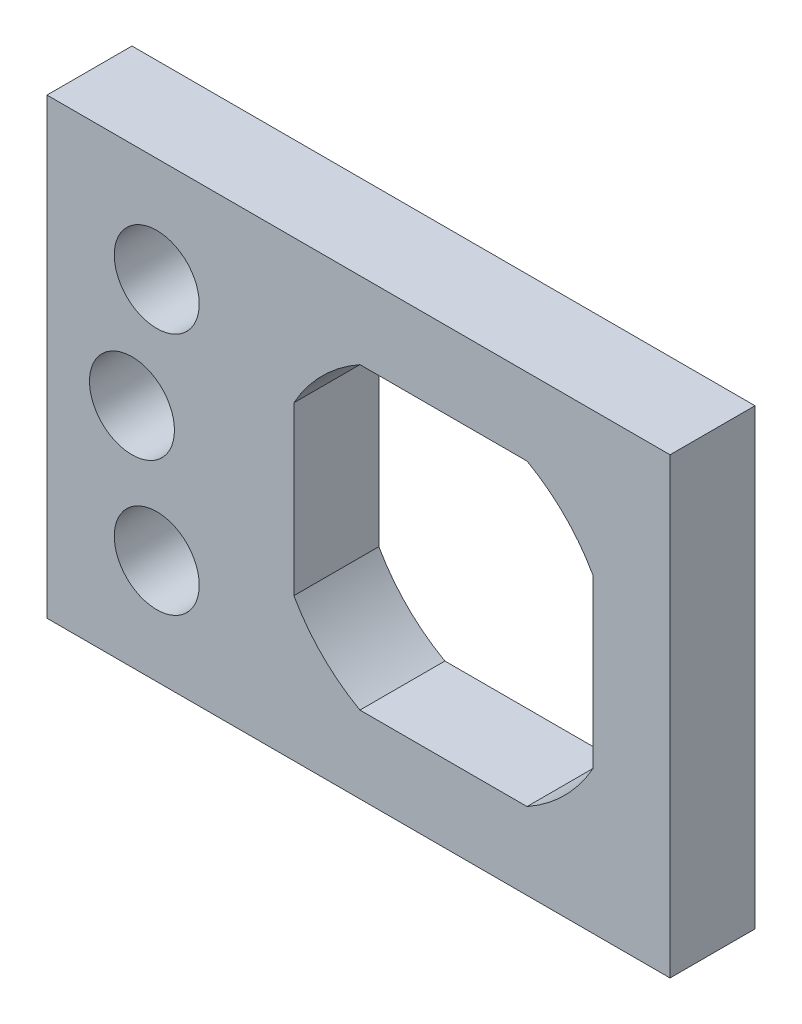
ISO-10303-21;
HEADER;
FILE_DESCRIPTION(('STEP AP214'),'2;1');
FILE_NAME('part.step','',(''),(''),'','','');
FILE_SCHEMA(('AUTOMOTIVE_DESIGN { 1 0 10303 214 1 1 1 1 }'));
ENDSEC;
DATA;
#1=APPLICATION_CONTEXT('core data for automotive mechanical design processes');
#2=APPLICATION_PROTOCOL_DEFINITION('international standard','automotive_design',2000,#1);
#3=PRODUCT_CONTEXT('',#1,'mechanical');
#4=PRODUCT('Part','Part','',(#3));
#5=PRODUCT_RELATED_PRODUCT_CATEGORY('part','',(#4));
#6=PRODUCT_DEFINITION_FORMATION('','',#4);
#7=PRODUCT_DEFINITION_CONTEXT('part definition',#1,'design');
#8=PRODUCT_DEFINITION('design','',#6,#7);
#9=PRODUCT_DEFINITION_SHAPE('','',#8);
#10=(LENGTH_UNIT() NAMED_UNIT(*) SI_UNIT(.MILLI.,.METRE.));
#11=(NAMED_UNIT(*) PLANE_ANGLE_UNIT() SI_UNIT($,.RADIAN.));
#12=(NAMED_UNIT(*) SI_UNIT($,.STERADIAN.) SOLID_ANGLE_UNIT());
#13=UNCERTAINTY_MEASURE_WITH_UNIT(LENGTH_MEASURE(1.E-05),#10,'distance_accuracy_value','');
#14=(GEOMETRIC_REPRESENTATION_CONTEXT(3) GLOBAL_UNCERTAINTY_ASSIGNED_CONTEXT((#13)) GLOBAL_UNIT_ASSIGNED_CONTEXT((#10,
#11,#12)) REPRESENTATION_CONTEXT('',''));
#15=CARTESIAN_POINT('',(0.,0.,0.));
#16=DIRECTION('',(0.,0.,1.));
#17=DIRECTION('',(1.,0.,0.));
#18=AXIS2_PLACEMENT_3D('',#15,#16,#17);
#19=CARTESIAN_POINT('',(0.,0.,0.));
#20=DIRECTION('',(0.,-1.,0.));
#21=DIRECTION('',(0.,0.,-1.));
#22=AXIS2_PLACEMENT_3D('',#19,#20,#21);
#23=PLANE('',#22);
#24=DIRECTION('',(-1.,0.,0.));
#25=VECTOR('',#24,1.);
#26=CARTESIAN_POINT('',(0.,0.,-15.));
#27=LINE('',#26,#25);
#28=CARTESIAN_POINT('',(0.,0.,-15.));
#29=VERTEX_POINT('',#28);
#30=CARTESIAN_POINT('',(-110.,0.,-15.));
#31=VERTEX_POINT('',#30);
#32=EDGE_CURVE('E173',#29,#31,#27,.T.);
#33=ORIENTED_EDGE('',*,*,#32,.T.);
#34=DIRECTION('',(0.,0.,-1.));
#35=VECTOR('',#34,1.);
#36=CARTESIAN_POINT('',(-110.,0.,0.));
#37=LINE('',#36,#35);
#38=CARTESIAN_POINT('',(-110.,0.,0.));
#39=VERTEX_POINT('',#38);
#40=EDGE_CURVE('E11',#39,#31,#37,.T.);
#41=ORIENTED_EDGE('',*,*,#40,.F.);
#42=DIRECTION('',(-1.,0.,0.));
#43=VECTOR('',#42,1.);
#44=CARTESIAN_POINT('',(0.,0.,0.));
#45=LINE('',#44,#43);
#46=CARTESIAN_POINT('',(0.,0.,0.));
#47=VERTEX_POINT('',#46);
#48=EDGE_CURVE('E137',#47,#39,#45,.T.);
#49=ORIENTED_EDGE('',*,*,#48,.F.);
#50=DIRECTION('',(0.,0.,-1.));
#51=VECTOR('',#50,1.);
#52=CARTESIAN_POINT('',(0.,0.,0.));
#53=LINE('',#52,#51);
#54=EDGE_CURVE('E53',#47,#29,#53,.T.);
#55=ORIENTED_EDGE('',*,*,#54,.T.);
#56=EDGE_LOOP('',(#33,#41,#49,#55));
#57=FACE_BOUND('',#56,.T.);
#58=ADVANCED_FACE('F34',(#57),#23,.F.);
#59=CARTESIAN_POINT('',(-110.,0.,0.));
#60=DIRECTION('',(1.,0.,0.));
#61=DIRECTION('',(0.,0.,-1.));
#62=AXIS2_PLACEMENT_3D('',#59,#60,#61);
#63=PLANE('',#62);
#64=DIRECTION('',(0.,-1.,0.));
#65=VECTOR('',#64,1.);
#66=CARTESIAN_POINT('',(-110.,0.,-15.));
#67=LINE('',#66,#65);
#68=CARTESIAN_POINT('',(-110.,-80.,-15.));
#69=VERTEX_POINT('',#68);
#70=EDGE_CURVE('E143',#31,#69,#67,.T.);
#71=ORIENTED_EDGE('',*,*,#70,.T.);
#72=DIRECTION('',(0.,0.,-1.));
#73=VECTOR('',#72,1.);
#74=CARTESIAN_POINT('',(-110.,-80.,0.));
#75=LINE('',#74,#73);
#76=CARTESIAN_POINT('',(-110.,-80.,0.));
#77=VERTEX_POINT('',#76);
#78=EDGE_CURVE('E44',#77,#69,#75,.T.);
#79=ORIENTED_EDGE('',*,*,#78,.F.);
#80=DIRECTION('',(0.,-1.,0.));
#81=VECTOR('',#80,1.);
#82=CARTESIAN_POINT('',(-110.,0.,0.));
#83=LINE('',#82,#81);
#84=EDGE_CURVE('E131',#39,#77,#83,.T.);
#85=ORIENTED_EDGE('',*,*,#84,.F.);
#86=ORIENTED_EDGE('',*,*,#40,.T.);
#87=EDGE_LOOP('',(#71,#79,#85,#86));
#88=FACE_BOUND('',#87,.T.);
#89=ADVANCED_FACE('F142',(#88),#63,.F.);
#90=CARTESIAN_POINT('',(0.,-80.,0.));
#91=DIRECTION('',(0.,-1.,0.));
#92=DIRECTION('',(1.,0.,0.));
#93=AXIS2_PLACEMENT_3D('',#90,#91,#92);
#94=PLANE('',#93);
#95=DIRECTION('',(-1.,0.,0.));
#96=VECTOR('',#95,1.);
#97=CARTESIAN_POINT('',(0.,-80.,-15.));
#98=LINE('',#97,#96);
#99=CARTESIAN_POINT('',(0.,-80.,-15.));
#100=VERTEX_POINT('',#99);
#101=EDGE_CURVE('E176',#100,#69,#98,.T.);
#102=ORIENTED_EDGE('',*,*,#101,.F.);
#103=DIRECTION('',(0.,0.,-1.));
#104=VECTOR('',#103,1.);
#105=CARTESIAN_POINT('',(0.,-80.,0.));
#106=LINE('',#105,#104);
#107=CARTESIAN_POINT('',(0.,-80.,0.));
#108=VERTEX_POINT('',#107);
#109=EDGE_CURVE('E91',#108,#100,#106,.T.);
#110=ORIENTED_EDGE('',*,*,#109,.F.);
#111=DIRECTION('',(-1.,0.,0.));
#112=VECTOR('',#111,1.);
#113=CARTESIAN_POINT('',(0.,-80.,0.));
#114=LINE('',#113,#112);
#115=EDGE_CURVE('E136',#108,#77,#114,.T.);
#116=ORIENTED_EDGE('',*,*,#115,.T.);
#117=ORIENTED_EDGE('',*,*,#78,.T.);
#118=EDGE_LOOP('',(#102,#110,#116,#117));
#119=FACE_BOUND('',#118,.T.);
#120=ADVANCED_FACE('F147',(#119),#94,.T.);
#121=CARTESIAN_POINT('',(-40.,-40.,0.));
#122=DIRECTION('',(0.,0.,-1.));
#123=DIRECTION('',(-1.,0.,0.));
#124=AXIS2_PLACEMENT_3D('',#121,#122,#123);
#125=CYLINDRICAL_SURFACE('',#124,30.25);
#126=CARTESIAN_POINT('',(-40.,-40.,-15.));
#127=DIRECTION('',(0.,0.,1.));
#128=DIRECTION('',(1.,0.,0.));
#129=AXIS2_PLACEMENT_3D('',#126,#127,#128);
#130=CIRCLE('',#129,30.25);
#131=CARTESIAN_POINT('',(-13.5897747075115,-25.25,-15.));
#132=VERTEX_POINT('',#131);
#133=CARTESIAN_POINT('',(-25.25,-13.5897747075115,-15.));
#134=VERTEX_POINT('',#133);
#135=EDGE_CURVE('E154',#132,#134,#130,.T.);
#136=ORIENTED_EDGE('',*,*,#135,.F.);
#137=DIRECTION('',(0.,0.,-1.));
#138=VECTOR('',#137,1.);
#139=CARTESIAN_POINT('',(-13.5897747075115,-25.25,0.));
#140=LINE('',#139,#138);
#141=CARTESIAN_POINT('',(-13.5897747075115,-25.25,0.));
#142=VERTEX_POINT('',#141);
#143=EDGE_CURVE('E38',#142,#132,#140,.T.);
#144=ORIENTED_EDGE('',*,*,#143,.F.);
#145=CARTESIAN_POINT('',(-40.,-40.,0.));
#146=DIRECTION('',(0.,0.,1.));
#147=DIRECTION('',(1.,0.,0.));
#148=AXIS2_PLACEMENT_3D('',#145,#146,#147);
#149=CIRCLE('',#148,30.25);
#150=CARTESIAN_POINT('',(-25.25,-13.5897747075115,0.));
#151=VERTEX_POINT('',#150);
#152=EDGE_CURVE('E181',#142,#151,#149,.T.);
#153=ORIENTED_EDGE('',*,*,#152,.T.);
#154=DIRECTION('',(0.,0.,-1.));
#155=VECTOR('',#154,1.);
#156=CARTESIAN_POINT('',(-25.25,-13.5897747075115,0.));
#157=LINE('',#156,#155);
#158=EDGE_CURVE('E150',#151,#134,#157,.T.);
#159=ORIENTED_EDGE('',*,*,#158,.T.);
#160=EDGE_LOOP('',(#136,#144,#153,#159));
#161=FACE_BOUND('',#160,.T.);
#162=ADVANCED_FACE('F204',(#161),#125,.F.);
#163=CARTESIAN_POINT('',(-13.5897747075115,0.,0.));
#164=DIRECTION('',(-1.,0.,0.));
#165=DIRECTION('',(0.,-1.,0.));
#166=AXIS2_PLACEMENT_3D('',#163,#164,#165);
#167=PLANE('',#166);
#168=DIRECTION('',(0.,1.,0.));
#169=VECTOR('',#168,1.);
#170=CARTESIAN_POINT('',(-13.5897747075115,0.,-15.));
#171=LINE('',#170,#169);
#172=CARTESIAN_POINT('',(-13.5897747075115,-54.75,-15.));
#173=VERTEX_POINT('',#172);
#174=EDGE_CURVE('E157',#173,#132,#171,.T.);
#175=ORIENTED_EDGE('',*,*,#174,.F.);
#176=DIRECTION('',(0.,0.,-1.));
#177=VECTOR('',#176,1.);
#178=CARTESIAN_POINT('',(-13.5897747075115,-54.75,0.));
#179=LINE('',#178,#177);
#180=CARTESIAN_POINT('',(-13.5897747075115,-54.75,0.));
#181=VERTEX_POINT('',#180);
#182=EDGE_CURVE('E194',#181,#173,#179,.T.);
#183=ORIENTED_EDGE('',*,*,#182,.F.);
#184=DIRECTION('',(0.,1.,0.));
#185=VECTOR('',#184,1.);
#186=CARTESIAN_POINT('',(-13.5897747075115,0.,0.));
#187=LINE('',#186,#185);
#188=EDGE_CURVE('E203',#181,#142,#187,.T.);
#189=ORIENTED_EDGE('',*,*,#188,.T.);
#190=ORIENTED_EDGE('',*,*,#143,.T.);
#191=EDGE_LOOP('',(#175,#183,#189,#190));
#192=FACE_BOUND('',#191,.T.);
#193=ADVANCED_FACE('F36',(#192),#167,.T.);
#194=CARTESIAN_POINT('',(-25.25,-66.4102252924885,-15.));
#195=VERTEX_POINT('',#194);
#196=EDGE_CURVE('E160',#195,#173,#130,.T.);
#197=ORIENTED_EDGE('',*,*,#196,.F.);
#198=DIRECTION('',(0.,0.,-1.));
#199=VECTOR('',#198,1.);
#200=CARTESIAN_POINT('',(-25.25,-66.4102252924885,0.));
#201=LINE('',#200,#199);
#202=CARTESIAN_POINT('',(-25.25,-66.4102252924885,0.));
#203=VERTEX_POINT('',#202);
#204=EDGE_CURVE('E193',#203,#195,#201,.T.);
#205=ORIENTED_EDGE('',*,*,#204,.F.);
#206=EDGE_CURVE('E237',#203,#181,#149,.T.);
#207=ORIENTED_EDGE('',*,*,#206,.T.);
#208=ORIENTED_EDGE('',*,*,#182,.T.);
#209=EDGE_LOOP('',(#197,#205,#207,#208));
#210=FACE_BOUND('',#209,.T.);
#211=ADVANCED_FACE('F236',(#210),#125,.F.);
#212=CARTESIAN_POINT('',(0.,-66.4102252924885,0.));
#213=DIRECTION('',(0.,1.,0.));
#214=DIRECTION('',(0.,0.,1.));
#215=AXIS2_PLACEMENT_3D('',#212,#213,#214);
#216=PLANE('',#215);
#217=DIRECTION('',(1.,0.,0.));
#218=VECTOR('',#217,1.);
#219=CARTESIAN_POINT('',(0.,-66.4102252924885,-15.));
#220=LINE('',#219,#218);
#221=CARTESIAN_POINT('',(-54.75,-66.4102252924885,-15.));
#222=VERTEX_POINT('',#221);
#223=EDGE_CURVE('E163',#222,#195,#220,.T.);
#224=ORIENTED_EDGE('',*,*,#223,.F.);
#225=DIRECTION('',(0.,0.,-1.));
#226=VECTOR('',#225,1.);
#227=CARTESIAN_POINT('',(-54.75,-66.4102252924885,0.));
#228=LINE('',#227,#226);
#229=CARTESIAN_POINT('',(-54.75,-66.4102252924885,0.));
#230=VERTEX_POINT('',#229);
#231=EDGE_CURVE('E191',#230,#222,#228,.T.);
#232=ORIENTED_EDGE('',*,*,#231,.F.);
#233=DIRECTION('',(1.,0.,0.));
#234=VECTOR('',#233,1.);
#235=CARTESIAN_POINT('',(0.,-66.4102252924885,0.));
#236=LINE('',#235,#234);
#237=EDGE_CURVE('E234',#230,#203,#236,.T.);
#238=ORIENTED_EDGE('',*,*,#237,.T.);
#239=ORIENTED_EDGE('',*,*,#204,.T.);
#240=EDGE_LOOP('',(#224,#232,#238,#239));
#241=FACE_BOUND('',#240,.T.);
#242=ADVANCED_FACE('F233',(#241),#216,.T.);
#243=CARTESIAN_POINT('',(-66.4102252924885,-54.75,-15.));
#244=VERTEX_POINT('',#243);
#245=EDGE_CURVE('E166',#244,#222,#130,.T.);
#246=ORIENTED_EDGE('',*,*,#245,.F.);
#247=DIRECTION('',(0.,0.,-1.));
#248=VECTOR('',#247,1.);
#249=CARTESIAN_POINT('',(-66.4102252924885,-54.75,0.));
#250=LINE('',#249,#248);
#251=CARTESIAN_POINT('',(-66.4102252924885,-54.75,0.));
#252=VERTEX_POINT('',#251);
#253=EDGE_CURVE('E189',#252,#244,#250,.T.);
#254=ORIENTED_EDGE('',*,*,#253,.F.);
#255=EDGE_CURVE('E229',#252,#230,#149,.T.);
#256=ORIENTED_EDGE('',*,*,#255,.T.);
#257=ORIENTED_EDGE('',*,*,#231,.T.);
#258=EDGE_LOOP('',(#246,#254,#256,#257));
#259=FACE_BOUND('',#258,.T.);
#260=ADVANCED_FACE('F228',(#259),#125,.F.);
#261=CARTESIAN_POINT('',(-66.4102252924885,0.,0.));
#262=DIRECTION('',(1.,0.,0.));
#263=DIRECTION('',(0.,0.,-1.));
#264=AXIS2_PLACEMENT_3D('',#261,#262,#263);
#265=PLANE('',#264);
#266=DIRECTION('',(0.,-1.,0.));
#267=VECTOR('',#266,1.);
#268=CARTESIAN_POINT('',(-66.4102252924885,0.,-15.));
#269=LINE('',#268,#267);
#270=CARTESIAN_POINT('',(-66.4102252924885,-25.25,-15.));
#271=VERTEX_POINT('',#270);
#272=EDGE_CURVE('E167',#271,#244,#269,.T.);
#273=ORIENTED_EDGE('',*,*,#272,.F.);
#274=DIRECTION('',(0.,0.,-1.));
#275=VECTOR('',#274,1.);
#276=CARTESIAN_POINT('',(-66.4102252924885,-25.25,0.));
#277=LINE('',#276,#275);
#278=CARTESIAN_POINT('',(-66.4102252924885,-25.25,0.));
#279=VERTEX_POINT('',#278);
#280=EDGE_CURVE('E187',#279,#271,#277,.T.);
#281=ORIENTED_EDGE('',*,*,#280,.F.);
#282=DIRECTION('',(0.,-1.,0.));
#283=VECTOR('',#282,1.);
#284=CARTESIAN_POINT('',(-66.4102252924885,0.,0.));
#285=LINE('',#284,#283);
#286=EDGE_CURVE('E224',#279,#252,#285,.T.);
#287=ORIENTED_EDGE('',*,*,#286,.T.);
#288=ORIENTED_EDGE('',*,*,#253,.T.);
#289=EDGE_LOOP('',(#273,#281,#287,#288));
#290=FACE_BOUND('',#289,.T.);
#291=ADVANCED_FACE('F223',(#290),#265,.T.);
#292=CARTESIAN_POINT('',(-54.75,-13.5897747075115,-15.));
#293=VERTEX_POINT('',#292);
#294=EDGE_CURVE('E159',#293,#271,#130,.T.);
#295=ORIENTED_EDGE('',*,*,#294,.F.);
#296=DIRECTION('',(0.,0.,-1.));
#297=VECTOR('',#296,1.);
#298=CARTESIAN_POINT('',(-54.75,-13.5897747075115,0.));
#299=LINE('',#298,#297);
#300=CARTESIAN_POINT('',(-54.75,-13.5897747075115,0.));
#301=VERTEX_POINT('',#300);
#302=EDGE_CURVE('E185',#301,#293,#299,.T.);
#303=ORIENTED_EDGE('',*,*,#302,.F.);
#304=EDGE_CURVE('E219',#301,#279,#149,.T.);
#305=ORIENTED_EDGE('',*,*,#304,.T.);
#306=ORIENTED_EDGE('',*,*,#280,.T.);
#307=EDGE_LOOP('',(#295,#303,#305,#306));
#308=FACE_BOUND('',#307,.T.);
#309=ADVANCED_FACE('F216',(#308),#125,.F.);
#310=CARTESIAN_POINT('',(0.,-13.5897747075115,0.));
#311=DIRECTION('',(0.,-1.,0.));
#312=DIRECTION('',(1.,0.,0.));
#313=AXIS2_PLACEMENT_3D('',#310,#311,#312);
#314=PLANE('',#313);
#315=DIRECTION('',(-1.,0.,0.));
#316=VECTOR('',#315,1.);
#317=CARTESIAN_POINT('',(0.,-13.5897747075115,-15.));
#318=LINE('',#317,#316);
#319=EDGE_CURVE('E170',#134,#293,#318,.T.);
#320=ORIENTED_EDGE('',*,*,#319,.F.);
#321=ORIENTED_EDGE('',*,*,#158,.F.);
#322=DIRECTION('',(-1.,0.,0.));
#323=VECTOR('',#322,1.);
#324=CARTESIAN_POINT('',(0.,-13.5897747075115,0.));
#325=LINE('',#324,#323);
#326=EDGE_CURVE('E244',#151,#301,#325,.T.);
#327=ORIENTED_EDGE('',*,*,#326,.T.);
#328=ORIENTED_EDGE('',*,*,#302,.T.);
#329=EDGE_LOOP('',(#320,#321,#327,#328));
#330=FACE_BOUND('',#329,.T.);
#331=ADVANCED_FACE('F249',(#330),#314,.T.);
#332=CARTESIAN_POINT('',(0.,0.,0.));
#333=DIRECTION('',(1.,0.,0.));
#334=DIRECTION('',(0.,1.,0.));
#335=AXIS2_PLACEMENT_3D('',#332,#333,#334);
#336=PLANE('',#335);
#337=DIRECTION('',(0.,-1.,0.));
#338=VECTOR('',#337,1.);
#339=CARTESIAN_POINT('',(0.,0.,-15.));
#340=LINE('',#339,#338);
#341=EDGE_CURVE('E178',#29,#100,#340,.T.);
#342=ORIENTED_EDGE('',*,*,#341,.F.);
#343=ORIENTED_EDGE('',*,*,#54,.F.);
#344=DIRECTION('',(0.,-1.,0.));
#345=VECTOR('',#344,1.);
#346=CARTESIAN_POINT('',(0.,0.,0.));
#347=LINE('',#346,#345);
#348=EDGE_CURVE('E148',#47,#108,#347,.T.);
#349=ORIENTED_EDGE('',*,*,#348,.T.);
#350=ORIENTED_EDGE('',*,*,#109,.T.);
#351=EDGE_LOOP('',(#342,#343,#349,#350));
#352=FACE_BOUND('',#351,.T.);
#353=ADVANCED_FACE('F251',(#352),#336,.T.);
#354=CARTESIAN_POINT('',(0.,0.,0.));
#355=DIRECTION('',(0.,0.,1.));
#356=DIRECTION('',(1.,0.,0.));
#357=AXIS2_PLACEMENT_3D('',#354,#355,#356);
#358=PLANE('',#357);
#359=CARTESIAN_POINT('',(-95.,-40.,0.));
#360=DIRECTION('',(0.,0.,1.));
#361=DIRECTION('',(1.,0.,0.));
#362=AXIS2_PLACEMENT_3D('',#359,#360,#361);
#363=CIRCLE('',#362,7.50000000000001);
#364=CARTESIAN_POINT('',(-87.5,-40.,0.));
#365=VERTEX_POINT('',#364);
#366=EDGE_CURVE('E290',#365,#365,#363,.T.);
#367=ORIENTED_EDGE('',*,*,#366,.F.);
#368=EDGE_LOOP('',(#367));
#369=FACE_BOUND('',#368,.T.);
#370=CARTESIAN_POINT('',(-90.6236110920586,-18.5,0.));
#371=DIRECTION('',(0.,0.,1.));
#372=DIRECTION('',(1.,0.,0.));
#373=AXIS2_PLACEMENT_3D('',#370,#371,#372);
#374=CIRCLE('',#373,7.50000000000001);
#375=CARTESIAN_POINT('',(-83.1236110920586,-18.5,0.));
#376=VERTEX_POINT('',#375);
#377=EDGE_CURVE('E294',#376,#376,#374,.T.);
#378=ORIENTED_EDGE('',*,*,#377,.F.);
#379=EDGE_LOOP('',(#378));
#380=FACE_BOUND('',#379,.T.);
#381=CARTESIAN_POINT('',(-90.6236110920586,-61.5,0.));
#382=DIRECTION('',(0.,0.,1.));
#383=DIRECTION('',(1.,0.,0.));
#384=AXIS2_PLACEMENT_3D('',#381,#382,#383);
#385=CIRCLE('',#384,7.50000000000001);
#386=CARTESIAN_POINT('',(-83.1236110920586,-61.5,0.));
#387=VERTEX_POINT('',#386);
#388=EDGE_CURVE('E303',#387,#387,#385,.T.);
#389=ORIENTED_EDGE('',*,*,#388,.F.);
#390=EDGE_LOOP('',(#389));
#391=FACE_BOUND('',#390,.T.);
#392=ORIENTED_EDGE('',*,*,#152,.F.);
#393=ORIENTED_EDGE('',*,*,#188,.F.);
#394=ORIENTED_EDGE('',*,*,#206,.F.);
#395=ORIENTED_EDGE('',*,*,#237,.F.);
#396=ORIENTED_EDGE('',*,*,#255,.F.);
#397=ORIENTED_EDGE('',*,*,#286,.F.);
#398=ORIENTED_EDGE('',*,*,#304,.F.);
#399=ORIENTED_EDGE('',*,*,#326,.F.);
#400=EDGE_LOOP('',(#392,#393,#394,#395,#396,#397,#398,#399));
#401=FACE_BOUND('',#400,.T.);
#402=ORIENTED_EDGE('',*,*,#48,.T.);
#403=ORIENTED_EDGE('',*,*,#84,.T.);
#404=ORIENTED_EDGE('',*,*,#115,.F.);
#405=ORIENTED_EDGE('',*,*,#348,.F.);
#406=EDGE_LOOP('',(#402,#403,#404,#405));
#407=FACE_BOUND('',#406,.T.);
#408=ADVANCED_FACE('F133',(#369,#380,#391,#401,#407),#358,.T.);
#409=CARTESIAN_POINT('',(0.,0.,-15.));
#410=DIRECTION('',(0.,0.,1.));
#411=DIRECTION('',(1.,0.,0.));
#412=AXIS2_PLACEMENT_3D('',#409,#410,#411);
#413=PLANE('',#412);
#414=CARTESIAN_POINT('',(-95.,-40.,-15.));
#415=DIRECTION('',(0.,0.,1.));
#416=DIRECTION('',(1.,0.,0.));
#417=AXIS2_PLACEMENT_3D('',#414,#415,#416);
#418=CIRCLE('',#417,7.50000000000001);
#419=CARTESIAN_POINT('',(-87.5,-40.,-15.));
#420=VERTEX_POINT('',#419);
#421=EDGE_CURVE('E293',#420,#420,#418,.F.);
#422=ORIENTED_EDGE('',*,*,#421,.F.);
#423=EDGE_LOOP('',(#422));
#424=FACE_BOUND('',#423,.T.);
#425=CARTESIAN_POINT('',(-90.6236110920586,-18.5,-15.));
#426=DIRECTION('',(0.,0.,1.));
#427=DIRECTION('',(1.,0.,0.));
#428=AXIS2_PLACEMENT_3D('',#425,#426,#427);
#429=CIRCLE('',#428,7.50000000000001);
#430=CARTESIAN_POINT('',(-83.1236110920586,-18.5,-15.));
#431=VERTEX_POINT('',#430);
#432=EDGE_CURVE('E297',#431,#431,#429,.F.);
#433=ORIENTED_EDGE('',*,*,#432,.F.);
#434=EDGE_LOOP('',(#433));
#435=FACE_BOUND('',#434,.T.);
#436=CARTESIAN_POINT('',(-90.6236110920586,-61.5,-15.));
#437=DIRECTION('',(0.,0.,1.));
#438=DIRECTION('',(1.,0.,0.));
#439=AXIS2_PLACEMENT_3D('',#436,#437,#438);
#440=CIRCLE('',#439,7.50000000000001);
#441=CARTESIAN_POINT('',(-83.1236110920586,-61.5,-15.));
#442=VERTEX_POINT('',#441);
#443=EDGE_CURVE('E158',#442,#442,#440,.F.);
#444=ORIENTED_EDGE('',*,*,#443,.F.);
#445=EDGE_LOOP('',(#444));
#446=FACE_BOUND('',#445,.T.);
#447=ORIENTED_EDGE('',*,*,#135,.T.);
#448=ORIENTED_EDGE('',*,*,#319,.T.);
#449=ORIENTED_EDGE('',*,*,#294,.T.);
#450=ORIENTED_EDGE('',*,*,#272,.T.);
#451=ORIENTED_EDGE('',*,*,#245,.T.);
#452=ORIENTED_EDGE('',*,*,#223,.T.);
#453=ORIENTED_EDGE('',*,*,#196,.T.);
#454=ORIENTED_EDGE('',*,*,#174,.T.);
#455=EDGE_LOOP('',(#447,#448,#449,#450,#451,#452,#453,#454));
#456=FACE_BOUND('',#455,.T.);
#457=ORIENTED_EDGE('',*,*,#32,.F.);
#458=ORIENTED_EDGE('',*,*,#341,.T.);
#459=ORIENTED_EDGE('',*,*,#101,.T.);
#460=ORIENTED_EDGE('',*,*,#70,.F.);
#461=EDGE_LOOP('',(#457,#458,#459,#460));
#462=FACE_BOUND('',#461,.T.);
#463=ADVANCED_FACE('F207',(#424,#435,#446,#456,#462),#413,.F.);
#464=CARTESIAN_POINT('',(-90.6236110920586,-61.5,-30.001));
#465=DIRECTION('',(0.,0.,1.));
#466=DIRECTION('',(1.,0.,0.));
#467=AXIS2_PLACEMENT_3D('',#464,#465,#466);
#468=CYLINDRICAL_SURFACE('',#467,7.50000000000001);
#469=ORIENTED_EDGE('',*,*,#388,.T.);
#470=EDGE_LOOP('',(#469));
#471=FACE_BOUND('',#470,.T.);
#472=ORIENTED_EDGE('',*,*,#443,.T.);
#473=EDGE_LOOP('',(#472));
#474=FACE_BOUND('',#473,.T.);
#475=ADVANCED_FACE('F270',(#471,#474),#468,.F.);
#476=CARTESIAN_POINT('',(-90.6236110920586,-18.5,-30.001));
#477=DIRECTION('',(0.,0.,1.));
#478=DIRECTION('',(1.,0.,0.));
#479=AXIS2_PLACEMENT_3D('',#476,#477,#478);
#480=CYLINDRICAL_SURFACE('',#479,7.50000000000001);
#481=ORIENTED_EDGE('',*,*,#377,.T.);
#482=EDGE_LOOP('',(#481));
#483=FACE_BOUND('',#482,.T.);
#484=ORIENTED_EDGE('',*,*,#432,.T.);
#485=EDGE_LOOP('',(#484));
#486=FACE_BOUND('',#485,.T.);
#487=ADVANCED_FACE('F277',(#483,#486),#480,.F.);
#488=CARTESIAN_POINT('',(-95.,-40.,-30.001));
#489=DIRECTION('',(0.,0.,1.));
#490=DIRECTION('',(1.,0.,0.));
#491=AXIS2_PLACEMENT_3D('',#488,#489,#490);
#492=CYLINDRICAL_SURFACE('',#491,7.50000000000001);
#493=ORIENTED_EDGE('',*,*,#366,.T.);
#494=EDGE_LOOP('',(#493));
#495=FACE_BOUND('',#494,.T.);
#496=ORIENTED_EDGE('',*,*,#421,.T.);
#497=EDGE_LOOP('',(#496));
#498=FACE_BOUND('',#497,.T.);
#499=ADVANCED_FACE('F281',(#495,#498),#492,.F.);
#500=CLOSED_SHELL('',(#58,#89,#120,#162,#193,#211,#242,#260,#291,#309,#331,#353,#408,#463,#475,
#487,#499));
#501=MANIFOLD_SOLID_BREP('B2',#500);
#502=ADVANCED_BREP_SHAPE_REPRESENTATION('',(#18,#501),#14);
#503=SHAPE_DEFINITION_REPRESENTATION(#9,#502);
ENDSEC;
END-ISO-10303-21;
